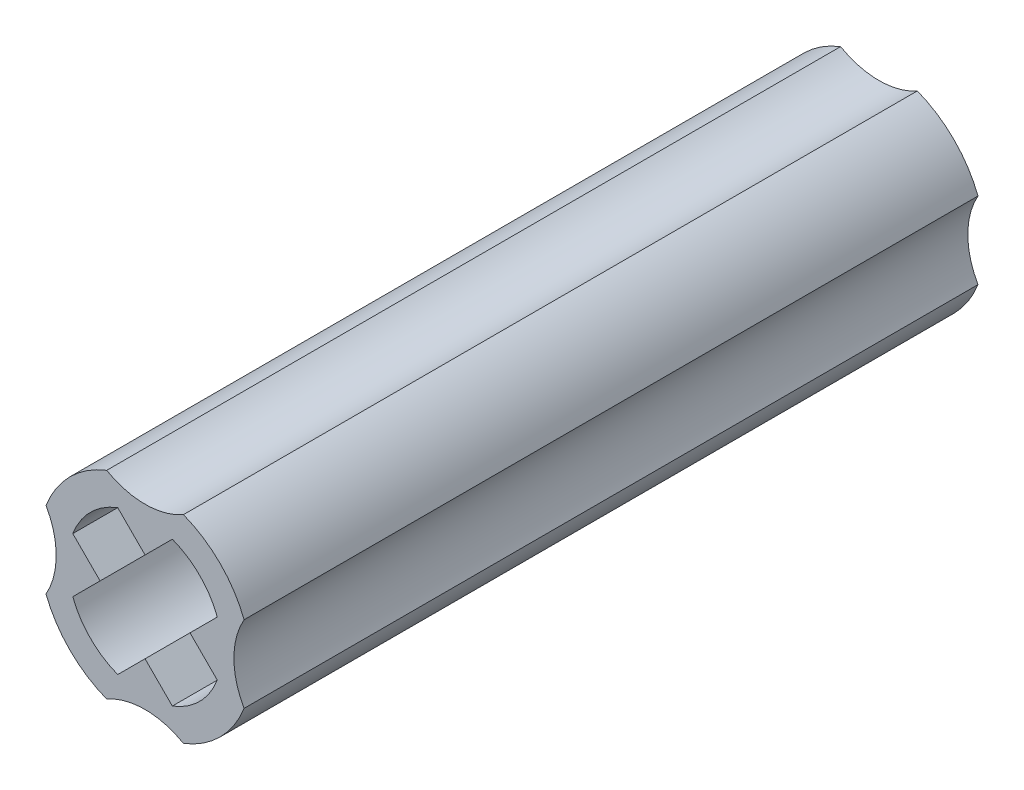
ISO-10303-21;
HEADER;
FILE_DESCRIPTION(('STEP AP214'),'2;1');
FILE_NAME('part.step','',(''),(''),'','','');
FILE_SCHEMA(('AUTOMOTIVE_DESIGN { 1 0 10303 214 1 1 1 1 }'));
ENDSEC;
DATA;
#1=APPLICATION_CONTEXT('core data for automotive mechanical design processes');
#2=APPLICATION_PROTOCOL_DEFINITION('international standard','automotive_design',2000,#1);
#3=PRODUCT_CONTEXT('',#1,'mechanical');
#4=PRODUCT('Part','Part','',(#3));
#5=PRODUCT_RELATED_PRODUCT_CATEGORY('part','',(#4));
#6=PRODUCT_DEFINITION_FORMATION('','',#4);
#7=PRODUCT_DEFINITION_CONTEXT('part definition',#1,'design');
#8=PRODUCT_DEFINITION('design','',#6,#7);
#9=PRODUCT_DEFINITION_SHAPE('','',#8);
#10=(LENGTH_UNIT() NAMED_UNIT(*) SI_UNIT(.MILLI.,.METRE.));
#11=(NAMED_UNIT(*) PLANE_ANGLE_UNIT() SI_UNIT($,.RADIAN.));
#12=(NAMED_UNIT(*) SI_UNIT($,.STERADIAN.) SOLID_ANGLE_UNIT());
#13=UNCERTAINTY_MEASURE_WITH_UNIT(LENGTH_MEASURE(1.E-05),#10,'distance_accuracy_value','');
#14=(GEOMETRIC_REPRESENTATION_CONTEXT(3) GLOBAL_UNCERTAINTY_ASSIGNED_CONTEXT((#13)) GLOBAL_UNIT_ASSIGNED_CONTEXT((#10,
#11,#12)) REPRESENTATION_CONTEXT('',''));
#15=CARTESIAN_POINT('',(0.,0.,0.));
#16=DIRECTION('',(0.,0.,1.));
#17=DIRECTION('',(1.,0.,0.));
#18=AXIS2_PLACEMENT_3D('',#15,#16,#17);
#19=CARTESIAN_POINT('',(0.,0.,-12.065));
#20=DIRECTION('',(0.,0.,1.));
#21=DIRECTION('',(1.,0.,0.));
#22=AXIS2_PLACEMENT_3D('',#19,#20,#21);
#23=CYLINDRICAL_SURFACE('',#22,2.54);
#24=CARTESIAN_POINT('',(0.,0.,-4.1275));
#25=DIRECTION('',(0.,0.,1.));
#26=DIRECTION('',(1.,0.,0.));
#27=AXIS2_PLACEMENT_3D('',#24,#25,#26);
#28=CIRCLE('',#27,2.54);
#29=CARTESIAN_POINT('',(-0.898025612106913,2.37595244060145,-4.1275));
#30=VERTEX_POINT('',#29);
#31=CARTESIAN_POINT('',(-2.37595244060146,0.898025612106913,-4.1275));
#32=VERTEX_POINT('',#31);
#33=EDGE_CURVE('E434',#30,#32,#28,.T.);
#34=ORIENTED_EDGE('',*,*,#33,.T.);
#35=DIRECTION('',(0.,0.,1.));
#36=VECTOR('',#35,1.);
#37=CARTESIAN_POINT('',(-2.37595244060146,0.898025612106913,-12.065));
#38=LINE('',#37,#36);
#39=CARTESIAN_POINT('',(-2.37595244060146,0.898025612106913,-12.065));
#40=VERTEX_POINT('',#39);
#41=EDGE_CURVE('E340',#40,#32,#38,.T.);
#42=ORIENTED_EDGE('',*,*,#41,.F.);
#43=CARTESIAN_POINT('',(0.,0.,-12.065));
#44=DIRECTION('',(0.,0.,1.));
#45=DIRECTION('',(1.,0.,0.));
#46=AXIS2_PLACEMENT_3D('',#43,#44,#45);
#47=CIRCLE('',#46,2.54);
#48=CARTESIAN_POINT('',(-0.898025612106913,2.37595244060145,-12.065));
#49=VERTEX_POINT('',#48);
#50=EDGE_CURVE('E556',#49,#40,#47,.T.);
#51=ORIENTED_EDGE('',*,*,#50,.F.);
#52=DIRECTION('',(0.,0.,1.));
#53=VECTOR('',#52,1.);
#54=CARTESIAN_POINT('',(-0.898025612106913,2.37595244060145,-12.065));
#55=LINE('',#54,#53);
#56=EDGE_CURVE('E376',#49,#30,#55,.T.);
#57=ORIENTED_EDGE('',*,*,#56,.T.);
#58=EDGE_LOOP('',(#34,#42,#51,#57));
#59=FACE_BOUND('',#58,.T.);
#60=ADVANCED_FACE('F38',(#59),#23,.F.);
#61=CARTESIAN_POINT('',(-0.898025612106913,2.37595244060145,-12.065));
#62=DIRECTION('',(0.707106781186549,0.707106781186546,0.));
#63=DIRECTION('',(-0.707106781186546,0.707106781186549,0.));
#64=AXIS2_PLACEMENT_3D('',#61,#62,#63);
#65=PLANE('',#64);
#66=DIRECTION('',(0.707106781186546,-0.707106781186549,0.));
#67=VECTOR('',#66,1.);
#68=CARTESIAN_POINT('',(-0.898025612106913,2.37595244060145,-4.1275));
#69=LINE('',#68,#67);
#70=CARTESIAN_POINT('',(0.,1.47792682849454,-4.1275));
#71=VERTEX_POINT('',#70);
#72=EDGE_CURVE('E54',#30,#71,#69,.T.);
#73=ORIENTED_EDGE('',*,*,#72,.F.);
#74=ORIENTED_EDGE('',*,*,#56,.F.);
#75=DIRECTION('',(-0.707106781186546,0.707106781186549,0.));
#76=VECTOR('',#75,1.);
#77=CARTESIAN_POINT('',(-0.898025612106913,2.37595244060145,-12.065));
#78=LINE('',#77,#76);
#79=CARTESIAN_POINT('',(0.,1.47792682849454,-12.065));
#80=VERTEX_POINT('',#79);
#81=EDGE_CURVE('E597',#80,#49,#78,.T.);
#82=ORIENTED_EDGE('',*,*,#81,.F.);
#83=DIRECTION('',(0.,0.,1.));
#84=VECTOR('',#83,1.);
#85=CARTESIAN_POINT('',(0.,1.47792682849454,-12.065));
#86=LINE('',#85,#84);
#87=EDGE_CURVE('E604',#80,#71,#86,.T.);
#88=ORIENTED_EDGE('',*,*,#87,.T.);
#89=EDGE_LOOP('',(#73,#74,#82,#88));
#90=FACE_BOUND('',#89,.T.);
#91=ADVANCED_FACE('F764',(#90),#65,.F.);
#92=CARTESIAN_POINT('',(0.,1.47792682849454,-12.065));
#93=DIRECTION('',(-0.70710678118655,0.707106781186545,0.));
#94=DIRECTION('',(-0.707106781186545,-0.70710678118655,0.));
#95=AXIS2_PLACEMENT_3D('',#92,#93,#94);
#96=PLANE('',#95);
#97=DIRECTION('',(0.707106781186545,0.70710678118655,0.));
#98=VECTOR('',#97,1.);
#99=CARTESIAN_POINT('',(0.,1.47792682849454,-4.1275));
#100=LINE('',#99,#98);
#101=CARTESIAN_POINT('',(0.898025612106914,2.37595244060146,-4.1275));
#102=VERTEX_POINT('',#101);
#103=EDGE_CURVE('E62',#71,#102,#100,.T.);
#104=ORIENTED_EDGE('',*,*,#103,.F.);
#105=ORIENTED_EDGE('',*,*,#87,.F.);
#106=DIRECTION('',(-0.707106781186545,-0.70710678118655,0.));
#107=VECTOR('',#106,1.);
#108=CARTESIAN_POINT('',(0.,1.47792682849454,-12.065));
#109=LINE('',#108,#107);
#110=CARTESIAN_POINT('',(0.898025612106914,2.37595244060146,-12.065));
#111=VERTEX_POINT('',#110);
#112=EDGE_CURVE('E593',#111,#80,#109,.T.);
#113=ORIENTED_EDGE('',*,*,#112,.F.);
#114=DIRECTION('',(0.,0.,1.));
#115=VECTOR('',#114,1.);
#116=CARTESIAN_POINT('',(0.898025612106914,2.37595244060146,-12.065));
#117=LINE('',#116,#115);
#118=EDGE_CURVE('E607',#111,#102,#117,.T.);
#119=ORIENTED_EDGE('',*,*,#118,.T.);
#120=EDGE_LOOP('',(#104,#105,#113,#119));
#121=FACE_BOUND('',#120,.T.);
#122=ADVANCED_FACE('F770',(#121),#96,.F.);
#123=CARTESIAN_POINT('',(0.,0.,-12.065));
#124=DIRECTION('',(0.,0.,1.));
#125=DIRECTION('',(1.,0.,0.));
#126=AXIS2_PLACEMENT_3D('',#123,#124,#125);
#127=CYLINDRICAL_SURFACE('',#126,2.54);
#128=CARTESIAN_POINT('',(2.37595244060145,0.898025612106914,-4.1275));
#129=VERTEX_POINT('',#128);
#130=EDGE_CURVE('E475',#129,#102,#28,.T.);
#131=ORIENTED_EDGE('',*,*,#130,.T.);
#132=ORIENTED_EDGE('',*,*,#118,.F.);
#133=CARTESIAN_POINT('',(0.,0.,-12.065));
#134=DIRECTION('',(0.,0.,1.));
#135=DIRECTION('',(1.,0.,0.));
#136=AXIS2_PLACEMENT_3D('',#133,#134,#135);
#137=CIRCLE('',#136,2.54);
#138=CARTESIAN_POINT('',(2.37595244060145,0.898025612106914,-12.065));
#139=VERTEX_POINT('',#138);
#140=EDGE_CURVE('E589',#139,#111,#137,.T.);
#141=ORIENTED_EDGE('',*,*,#140,.F.);
#142=DIRECTION('',(0.,0.,1.));
#143=VECTOR('',#142,1.);
#144=CARTESIAN_POINT('',(2.37595244060145,0.898025612106914,-12.065));
#145=LINE('',#144,#143);
#146=EDGE_CURVE('E312',#139,#129,#145,.T.);
#147=ORIENTED_EDGE('',*,*,#146,.T.);
#148=EDGE_LOOP('',(#131,#132,#141,#147));
#149=FACE_BOUND('',#148,.T.);
#150=ADVANCED_FACE('F873',(#149),#127,.F.);
#151=CARTESIAN_POINT('',(2.37595244060145,0.898025612106913,-12.065));
#152=DIRECTION('',(0.707106781186546,-0.707106781186549,0.));
#153=DIRECTION('',(0.707106781186549,0.707106781186546,0.));
#154=AXIS2_PLACEMENT_3D('',#151,#152,#153);
#155=PLANE('',#154);
#156=DIRECTION('',(-0.707106781186549,-0.707106781186546,0.));
#157=VECTOR('',#156,1.);
#158=CARTESIAN_POINT('',(2.37595244060145,0.898025612106913,-4.1275));
#159=LINE('',#158,#157);
#160=CARTESIAN_POINT('',(1.47792682849454,0.,-4.1275));
#161=VERTEX_POINT('',#160);
#162=EDGE_CURVE('E488',#129,#161,#159,.T.);
#163=ORIENTED_EDGE('',*,*,#162,.F.);
#164=ORIENTED_EDGE('',*,*,#146,.F.);
#165=DIRECTION('',(0.707106781186548,0.707106781186546,0.));
#166=VECTOR('',#165,1.);
#167=CARTESIAN_POINT('',(2.37595244060145,0.898025612106913,-12.065));
#168=LINE('',#167,#166);
#169=CARTESIAN_POINT('',(1.47792682849454,0.,-12.065));
#170=VERTEX_POINT('',#169);
#171=EDGE_CURVE('E585',#170,#139,#168,.T.);
#172=ORIENTED_EDGE('',*,*,#171,.F.);
#173=DIRECTION('',(0.,0.,1.));
#174=VECTOR('',#173,1.);
#175=CARTESIAN_POINT('',(1.47792682849454,0.,-12.065));
#176=LINE('',#175,#174);
#177=EDGE_CURVE('E301',#170,#161,#176,.T.);
#178=ORIENTED_EDGE('',*,*,#177,.T.);
#179=EDGE_LOOP('',(#163,#164,#172,#178));
#180=FACE_BOUND('',#179,.T.);
#181=ADVANCED_FACE('F870',(#180),#155,.F.);
#182=CARTESIAN_POINT('',(1.47792682849454,0.,-12.065));
#183=DIRECTION('',(0.707106781186545,0.70710678118655,0.));
#184=DIRECTION('',(-0.70710678118655,0.707106781186545,0.));
#185=AXIS2_PLACEMENT_3D('',#182,#183,#184);
#186=PLANE('',#185);
#187=DIRECTION('',(0.70710678118655,-0.707106781186545,0.));
#188=VECTOR('',#187,1.);
#189=CARTESIAN_POINT('',(1.47792682849454,0.,-4.1275));
#190=LINE('',#189,#188);
#191=CARTESIAN_POINT('',(2.37595244060146,-0.898025612106914,-4.1275));
#192=VERTEX_POINT('',#191);
#193=EDGE_CURVE('E484',#161,#192,#190,.T.);
#194=ORIENTED_EDGE('',*,*,#193,.F.);
#195=ORIENTED_EDGE('',*,*,#177,.F.);
#196=DIRECTION('',(-0.70710678118655,0.707106781186545,0.));
#197=VECTOR('',#196,1.);
#198=CARTESIAN_POINT('',(1.47792682849454,0.,-12.065));
#199=LINE('',#198,#197);
#200=CARTESIAN_POINT('',(2.37595244060146,-0.898025612106914,-12.065));
#201=VERTEX_POINT('',#200);
#202=EDGE_CURVE('E581',#201,#170,#199,.T.);
#203=ORIENTED_EDGE('',*,*,#202,.F.);
#204=DIRECTION('',(0.,0.,1.));
#205=VECTOR('',#204,1.);
#206=CARTESIAN_POINT('',(2.37595244060146,-0.898025612106914,-12.065));
#207=LINE('',#206,#205);
#208=EDGE_CURVE('E302',#201,#192,#207,.T.);
#209=ORIENTED_EDGE('',*,*,#208,.T.);
#210=EDGE_LOOP('',(#194,#195,#203,#209));
#211=FACE_BOUND('',#210,.T.);
#212=ADVANCED_FACE('F867',(#211),#186,.F.);
#213=CARTESIAN_POINT('',(0.,0.,-12.065));
#214=DIRECTION('',(0.,0.,1.));
#215=DIRECTION('',(1.,0.,0.));
#216=AXIS2_PLACEMENT_3D('',#213,#214,#215);
#217=CYLINDRICAL_SURFACE('',#216,2.54);
#218=CARTESIAN_POINT('',(0.898025612106912,-2.37595244060145,-4.1275));
#219=VERTEX_POINT('',#218);
#220=EDGE_CURVE('E285',#219,#192,#28,.T.);
#221=ORIENTED_EDGE('',*,*,#220,.T.);
#222=ORIENTED_EDGE('',*,*,#208,.F.);
#223=CARTESIAN_POINT('',(0.,0.,-12.065));
#224=DIRECTION('',(0.,0.,1.));
#225=DIRECTION('',(1.,0.,0.));
#226=AXIS2_PLACEMENT_3D('',#223,#224,#225);
#227=CIRCLE('',#226,2.54);
#228=CARTESIAN_POINT('',(0.898025612106912,-2.37595244060145,-12.065));
#229=VERTEX_POINT('',#228);
#230=EDGE_CURVE('E577',#229,#201,#227,.T.);
#231=ORIENTED_EDGE('',*,*,#230,.F.);
#232=DIRECTION('',(0.,0.,1.));
#233=VECTOR('',#232,1.);
#234=CARTESIAN_POINT('',(0.898025612106912,-2.37595244060145,-12.065));
#235=LINE('',#234,#233);
#236=EDGE_CURVE('E315',#229,#219,#235,.T.);
#237=ORIENTED_EDGE('',*,*,#236,.T.);
#238=EDGE_LOOP('',(#221,#222,#231,#237));
#239=FACE_BOUND('',#238,.T.);
#240=ADVANCED_FACE('F864',(#239),#217,.F.);
#241=CARTESIAN_POINT('',(0.898025612106914,-2.37595244060145,-12.065));
#242=DIRECTION('',(-0.707106781186549,-0.707106781186547,0.));
#243=DIRECTION('',(0.707106781186547,-0.707106781186549,0.));
#244=AXIS2_PLACEMENT_3D('',#241,#242,#243);
#245=PLANE('',#244);
#246=DIRECTION('',(-0.707106781186547,0.707106781186549,0.));
#247=VECTOR('',#246,1.);
#248=CARTESIAN_POINT('',(0.898025612106914,-2.37595244060145,-4.1275));
#249=LINE('',#248,#247);
#250=CARTESIAN_POINT('',(0.,-1.47792682849454,-4.1275));
#251=VERTEX_POINT('',#250);
#252=EDGE_CURVE('E480',#219,#251,#249,.T.);
#253=ORIENTED_EDGE('',*,*,#252,.F.);
#254=ORIENTED_EDGE('',*,*,#236,.F.);
#255=DIRECTION('',(0.707106781186546,-0.707106781186548,0.));
#256=VECTOR('',#255,1.);
#257=CARTESIAN_POINT('',(0.898025612106914,-2.37595244060145,-12.065));
#258=LINE('',#257,#256);
#259=CARTESIAN_POINT('',(0.,-1.47792682849454,-12.065));
#260=VERTEX_POINT('',#259);
#261=EDGE_CURVE('E573',#260,#229,#258,.T.);
#262=ORIENTED_EDGE('',*,*,#261,.F.);
#263=DIRECTION('',(0.,0.,1.));
#264=VECTOR('',#263,1.);
#265=CARTESIAN_POINT('',(0.,-1.47792682849454,-12.065));
#266=LINE('',#265,#264);
#267=EDGE_CURVE('E320',#260,#251,#266,.T.);
#268=ORIENTED_EDGE('',*,*,#267,.T.);
#269=EDGE_LOOP('',(#253,#254,#262,#268));
#270=FACE_BOUND('',#269,.T.);
#271=ADVANCED_FACE('F861',(#270),#245,.F.);
#272=CARTESIAN_POINT('',(0.,-1.47792682849454,-12.065));
#273=DIRECTION('',(0.70710678118655,-0.707106781186545,0.));
#274=DIRECTION('',(0.707106781186545,0.70710678118655,0.));
#275=AXIS2_PLACEMENT_3D('',#272,#273,#274);
#276=PLANE('',#275);
#277=DIRECTION('',(-0.707106781186545,-0.70710678118655,0.));
#278=VECTOR('',#277,1.);
#279=CARTESIAN_POINT('',(0.,-1.47792682849454,-4.1275));
#280=LINE('',#279,#278);
#281=CARTESIAN_POINT('',(-0.898025612106913,-2.37595244060146,-4.1275));
#282=VERTEX_POINT('',#281);
#283=EDGE_CURVE('E457',#251,#282,#280,.T.);
#284=ORIENTED_EDGE('',*,*,#283,.F.);
#285=ORIENTED_EDGE('',*,*,#267,.F.);
#286=DIRECTION('',(0.707106781186545,0.70710678118655,0.));
#287=VECTOR('',#286,1.);
#288=CARTESIAN_POINT('',(0.,-1.47792682849454,-12.065));
#289=LINE('',#288,#287);
#290=CARTESIAN_POINT('',(-0.898025612106913,-2.37595244060146,-12.065));
#291=VERTEX_POINT('',#290);
#292=EDGE_CURVE('E569',#291,#260,#289,.T.);
#293=ORIENTED_EDGE('',*,*,#292,.F.);
#294=DIRECTION('',(0.,0.,1.));
#295=VECTOR('',#294,1.);
#296=CARTESIAN_POINT('',(-0.898025612106913,-2.37595244060146,-12.065));
#297=LINE('',#296,#295);
#298=EDGE_CURVE('E325',#291,#282,#297,.T.);
#299=ORIENTED_EDGE('',*,*,#298,.T.);
#300=EDGE_LOOP('',(#284,#285,#293,#299));
#301=FACE_BOUND('',#300,.T.);
#302=ADVANCED_FACE('F858',(#301),#276,.F.);
#303=CARTESIAN_POINT('',(0.,0.,-12.065));
#304=DIRECTION('',(0.,0.,1.));
#305=DIRECTION('',(1.,0.,0.));
#306=AXIS2_PLACEMENT_3D('',#303,#304,#305);
#307=CYLINDRICAL_SURFACE('',#306,2.54);
#308=CARTESIAN_POINT('',(-2.37595244060145,-0.898025612106914,-4.1275));
#309=VERTEX_POINT('',#308);
#310=EDGE_CURVE('E455',#309,#282,#28,.T.);
#311=ORIENTED_EDGE('',*,*,#310,.T.);
#312=ORIENTED_EDGE('',*,*,#298,.F.);
#313=CARTESIAN_POINT('',(0.,0.,-12.065));
#314=DIRECTION('',(0.,0.,1.));
#315=DIRECTION('',(1.,0.,0.));
#316=AXIS2_PLACEMENT_3D('',#313,#314,#315);
#317=CIRCLE('',#316,2.54);
#318=CARTESIAN_POINT('',(-2.37595244060145,-0.898025612106914,-12.065));
#319=VERTEX_POINT('',#318);
#320=EDGE_CURVE('E565',#319,#291,#317,.T.);
#321=ORIENTED_EDGE('',*,*,#320,.F.);
#322=DIRECTION('',(0.,0.,1.));
#323=VECTOR('',#322,1.);
#324=CARTESIAN_POINT('',(-2.37595244060145,-0.898025612106914,-12.065));
#325=LINE('',#324,#323);
#326=EDGE_CURVE('E330',#319,#309,#325,.T.);
#327=ORIENTED_EDGE('',*,*,#326,.T.);
#328=EDGE_LOOP('',(#311,#312,#321,#327));
#329=FACE_BOUND('',#328,.T.);
#330=ADVANCED_FACE('F845',(#329),#307,.F.);
#331=CARTESIAN_POINT('',(-2.37595244060145,-0.898025612106914,-12.065));
#332=DIRECTION('',(-0.707106781186547,0.707106781186549,0.));
#333=DIRECTION('',(-0.707106781186549,-0.707106781186547,0.));
#334=AXIS2_PLACEMENT_3D('',#331,#332,#333);
#335=PLANE('',#334);
#336=DIRECTION('',(0.707106781186549,0.707106781186547,0.));
#337=VECTOR('',#336,1.);
#338=CARTESIAN_POINT('',(-2.37595244060145,-0.898025612106914,-4.1275));
#339=LINE('',#338,#337);
#340=CARTESIAN_POINT('',(-1.47792682849454,0.,-4.1275));
#341=VERTEX_POINT('',#340);
#342=EDGE_CURVE('E445',#309,#341,#339,.T.);
#343=ORIENTED_EDGE('',*,*,#342,.F.);
#344=ORIENTED_EDGE('',*,*,#326,.F.);
#345=DIRECTION('',(-0.707106781186548,-0.707106781186546,0.));
#346=VECTOR('',#345,1.);
#347=CARTESIAN_POINT('',(-2.37595244060145,-0.898025612106914,-12.065));
#348=LINE('',#347,#346);
#349=CARTESIAN_POINT('',(-1.47792682849454,0.,-12.065));
#350=VERTEX_POINT('',#349);
#351=EDGE_CURVE('E447',#350,#319,#348,.T.);
#352=ORIENTED_EDGE('',*,*,#351,.F.);
#353=DIRECTION('',(0.,0.,1.));
#354=VECTOR('',#353,1.);
#355=CARTESIAN_POINT('',(-1.47792682849454,0.,-12.065));
#356=LINE('',#355,#354);
#357=EDGE_CURVE('E335',#350,#341,#356,.T.);
#358=ORIENTED_EDGE('',*,*,#357,.T.);
#359=EDGE_LOOP('',(#343,#344,#352,#358));
#360=FACE_BOUND('',#359,.T.);
#361=ADVANCED_FACE('F444',(#360),#335,.F.);
#362=CARTESIAN_POINT('',(-1.47792682849454,0.,-12.065));
#363=DIRECTION('',(-0.707106781186545,-0.70710678118655,0.));
#364=DIRECTION('',(0.70710678118655,-0.707106781186545,0.));
#365=AXIS2_PLACEMENT_3D('',#362,#363,#364);
#366=PLANE('',#365);
#367=DIRECTION('',(-0.70710678118655,0.707106781186545,0.));
#368=VECTOR('',#367,1.);
#369=CARTESIAN_POINT('',(-1.47792682849454,0.,-4.1275));
#370=LINE('',#369,#368);
#371=EDGE_CURVE('E47',#341,#32,#370,.T.);
#372=ORIENTED_EDGE('',*,*,#371,.F.);
#373=ORIENTED_EDGE('',*,*,#357,.F.);
#374=DIRECTION('',(0.70710678118655,-0.707106781186545,0.));
#375=VECTOR('',#374,1.);
#376=CARTESIAN_POINT('',(-1.47792682849454,0.,-12.065));
#377=LINE('',#376,#375);
#378=EDGE_CURVE('E560',#40,#350,#377,.T.);
#379=ORIENTED_EDGE('',*,*,#378,.F.);
#380=ORIENTED_EDGE('',*,*,#41,.T.);
#381=EDGE_LOOP('',(#372,#373,#379,#380));
#382=FACE_BOUND('',#381,.T.);
#383=ADVANCED_FACE('F439',(#382),#366,.F.);
#384=CARTESIAN_POINT('',(0.,0.,12.065));
#385=DIRECTION('',(0.,0.,-1.));
#386=DIRECTION('',(-1.,0.,0.));
#387=AXIS2_PLACEMENT_3D('',#384,#385,#386);
#388=CYLINDRICAL_SURFACE('',#387,3.4925);
#389=CARTESIAN_POINT('',(0.,0.,-12.065));
#390=DIRECTION('',(0.,0.,1.));
#391=DIRECTION('',(1.,0.,0.));
#392=AXIS2_PLACEMENT_3D('',#389,#390,#391);
#393=CIRCLE('',#392,3.4925);
#394=CARTESIAN_POINT('',(-1.26181498824251,3.25659011627907,-12.065));
#395=VERTEX_POINT('',#394);
#396=CARTESIAN_POINT('',(-3.25659011627907,1.26181498824253,-12.065));
#397=VERTEX_POINT('',#396);
#398=EDGE_CURVE('E371',#395,#397,#393,.T.);
#399=ORIENTED_EDGE('',*,*,#398,.T.);
#400=DIRECTION('',(0.,0.,-1.));
#401=VECTOR('',#400,1.);
#402=CARTESIAN_POINT('',(-3.25659011627907,1.26181498824253,12.065));
#403=LINE('',#402,#401);
#404=CARTESIAN_POINT('',(-3.25659011627907,1.26181498824253,12.065));
#405=VERTEX_POINT('',#404);
#406=EDGE_CURVE('E423',#405,#397,#403,.T.);
#407=ORIENTED_EDGE('',*,*,#406,.F.);
#408=CARTESIAN_POINT('',(0.,0.,12.065));
#409=DIRECTION('',(0.,0.,1.));
#410=DIRECTION('',(1.,0.,0.));
#411=AXIS2_PLACEMENT_3D('',#408,#409,#410);
#412=CIRCLE('',#411,3.4925);
#413=CARTESIAN_POINT('',(-1.26181498824251,3.25659011627907,12.065));
#414=VERTEX_POINT('',#413);
#415=EDGE_CURVE('E344',#414,#405,#412,.T.);
#416=ORIENTED_EDGE('',*,*,#415,.F.);
#417=DIRECTION('',(0.,0.,-1.));
#418=VECTOR('',#417,1.);
#419=CARTESIAN_POINT('',(-1.26181498824251,3.25659011627907,12.065));
#420=LINE('',#419,#418);
#421=EDGE_CURVE('E370',#414,#395,#420,.T.);
#422=ORIENTED_EDGE('',*,*,#421,.T.);
#423=EDGE_LOOP('',(#399,#407,#416,#422));
#424=FACE_BOUND('',#423,.T.);
#425=ADVANCED_FACE('F40',(#424),#388,.T.);
#426=CARTESIAN_POINT('',(-5.461,0.,12.065));
#427=DIRECTION('',(0.,0.,-1.));
#428=DIRECTION('',(-1.,0.,0.));
#429=AXIS2_PLACEMENT_3D('',#426,#427,#428);
#430=CYLINDRICAL_SURFACE('',#429,2.54);
#431=CARTESIAN_POINT('',(-5.461,0.,-12.065));
#432=DIRECTION('',(0.,0.,-1.));
#433=DIRECTION('',(1.,0.,0.));
#434=AXIS2_PLACEMENT_3D('',#431,#432,#433);
#435=CIRCLE('',#434,2.54);
#436=CARTESIAN_POINT('',(-3.25659011627907,-1.26181498824253,-12.065));
#437=VERTEX_POINT('',#436);
#438=EDGE_CURVE('E375',#397,#437,#435,.T.);
#439=ORIENTED_EDGE('',*,*,#438,.T.);
#440=DIRECTION('',(0.,0.,-1.));
#441=VECTOR('',#440,1.);
#442=CARTESIAN_POINT('',(-3.25659011627907,-1.26181498824253,12.065));
#443=LINE('',#442,#441);
#444=CARTESIAN_POINT('',(-3.25659011627907,-1.26181498824253,12.065));
#445=VERTEX_POINT('',#444);
#446=EDGE_CURVE('E419',#445,#437,#443,.T.);
#447=ORIENTED_EDGE('',*,*,#446,.F.);
#448=CARTESIAN_POINT('',(-5.461,0.,12.065));
#449=DIRECTION('',(0.,0.,-1.));
#450=DIRECTION('',(1.,0.,0.));
#451=AXIS2_PLACEMENT_3D('',#448,#449,#450);
#452=CIRCLE('',#451,2.54);
#453=EDGE_CURVE('E348',#405,#445,#452,.T.);
#454=ORIENTED_EDGE('',*,*,#453,.F.);
#455=ORIENTED_EDGE('',*,*,#406,.T.);
#456=EDGE_LOOP('',(#439,#447,#454,#455));
#457=FACE_BOUND('',#456,.T.);
#458=ADVANCED_FACE('F809',(#457),#430,.F.);
#459=CARTESIAN_POINT('',(0.,0.,12.065));
#460=DIRECTION('',(0.,0.,-1.));
#461=DIRECTION('',(-1.,0.,0.));
#462=AXIS2_PLACEMENT_3D('',#459,#460,#461);
#463=CYLINDRICAL_SURFACE('',#462,3.4925);
#464=CARTESIAN_POINT('',(0.,0.,-12.065));
#465=DIRECTION('',(0.,0.,1.));
#466=DIRECTION('',(1.,0.,0.));
#467=AXIS2_PLACEMENT_3D('',#464,#465,#466);
#468=CIRCLE('',#467,3.4925);
#469=CARTESIAN_POINT('',(-1.26181498824256,-3.25659011627906,-12.065));
#470=VERTEX_POINT('',#469);
#471=EDGE_CURVE('E379',#437,#470,#468,.T.);
#472=ORIENTED_EDGE('',*,*,#471,.T.);
#473=DIRECTION('',(0.,0.,-1.));
#474=VECTOR('',#473,1.);
#475=CARTESIAN_POINT('',(-1.26181498824256,-3.25659011627906,12.065));
#476=LINE('',#475,#474);
#477=CARTESIAN_POINT('',(-1.26181498824256,-3.25659011627906,12.065));
#478=VERTEX_POINT('',#477);
#479=EDGE_CURVE('E415',#478,#470,#476,.T.);
#480=ORIENTED_EDGE('',*,*,#479,.F.);
#481=CARTESIAN_POINT('',(0.,0.,12.065));
#482=DIRECTION('',(0.,0.,1.));
#483=DIRECTION('',(1.,0.,0.));
#484=AXIS2_PLACEMENT_3D('',#481,#482,#483);
#485=CIRCLE('',#484,3.4925);
#486=EDGE_CURVE('E352',#445,#478,#485,.T.);
#487=ORIENTED_EDGE('',*,*,#486,.F.);
#488=ORIENTED_EDGE('',*,*,#446,.T.);
#489=EDGE_LOOP('',(#472,#480,#487,#488));
#490=FACE_BOUND('',#489,.T.);
#491=ADVANCED_FACE('F806',(#490),#463,.T.);
#492=CARTESIAN_POINT('',(0.,-5.461,12.065));
#493=DIRECTION('',(0.,0.,-1.));
#494=DIRECTION('',(-1.,0.,0.));
#495=AXIS2_PLACEMENT_3D('',#492,#493,#494);
#496=CYLINDRICAL_SURFACE('',#495,2.54);
#497=CARTESIAN_POINT('',(0.,-5.461,-12.065));
#498=DIRECTION('',(0.,0.,-1.));
#499=DIRECTION('',(1.,0.,0.));
#500=AXIS2_PLACEMENT_3D('',#497,#498,#499);
#501=CIRCLE('',#500,2.54);
#502=CARTESIAN_POINT('',(1.26181498824249,-3.25659011627908,-12.065));
#503=VERTEX_POINT('',#502);
#504=EDGE_CURVE('E382',#470,#503,#501,.T.);
#505=ORIENTED_EDGE('',*,*,#504,.T.);
#506=DIRECTION('',(0.,0.,-1.));
#507=VECTOR('',#506,1.);
#508=CARTESIAN_POINT('',(1.26181498824249,-3.25659011627908,12.065));
#509=LINE('',#508,#507);
#510=CARTESIAN_POINT('',(1.26181498824249,-3.25659011627908,12.065));
#511=VERTEX_POINT('',#510);
#512=EDGE_CURVE('E411',#511,#503,#509,.T.);
#513=ORIENTED_EDGE('',*,*,#512,.F.);
#514=CARTESIAN_POINT('',(0.,-5.461,12.065));
#515=DIRECTION('',(0.,0.,-1.));
#516=DIRECTION('',(1.,0.,0.));
#517=AXIS2_PLACEMENT_3D('',#514,#515,#516);
#518=CIRCLE('',#517,2.54);
#519=EDGE_CURVE('E355',#478,#511,#518,.T.);
#520=ORIENTED_EDGE('',*,*,#519,.F.);
#521=ORIENTED_EDGE('',*,*,#479,.T.);
#522=EDGE_LOOP('',(#505,#513,#520,#521));
#523=FACE_BOUND('',#522,.T.);
#524=ADVANCED_FACE('F802',(#523),#496,.F.);
#525=CARTESIAN_POINT('',(0.,0.,12.065));
#526=DIRECTION('',(0.,0.,-1.));
#527=DIRECTION('',(-1.,0.,0.));
#528=AXIS2_PLACEMENT_3D('',#525,#526,#527);
#529=CYLINDRICAL_SURFACE('',#528,3.4925);
#530=CARTESIAN_POINT('',(0.,0.,-12.065));
#531=DIRECTION('',(0.,0.,1.));
#532=DIRECTION('',(1.,0.,0.));
#533=AXIS2_PLACEMENT_3D('',#530,#531,#532);
#534=CIRCLE('',#533,3.4925);
#535=CARTESIAN_POINT('',(3.25659011627906,-1.26181498824255,-12.065));
#536=VERTEX_POINT('',#535);
#537=EDGE_CURVE('E385',#503,#536,#534,.T.);
#538=ORIENTED_EDGE('',*,*,#537,.T.);
#539=DIRECTION('',(0.,0.,-1.));
#540=VECTOR('',#539,1.);
#541=CARTESIAN_POINT('',(3.25659011627906,-1.26181498824255,12.065));
#542=LINE('',#541,#540);
#543=CARTESIAN_POINT('',(3.25659011627906,-1.26181498824255,12.065));
#544=VERTEX_POINT('',#543);
#545=EDGE_CURVE('E407',#544,#536,#542,.T.);
#546=ORIENTED_EDGE('',*,*,#545,.F.);
#547=CARTESIAN_POINT('',(0.,0.,12.065));
#548=DIRECTION('',(0.,0.,1.));
#549=DIRECTION('',(1.,0.,0.));
#550=AXIS2_PLACEMENT_3D('',#547,#548,#549);
#551=CIRCLE('',#550,3.4925);
#552=EDGE_CURVE('E358',#511,#544,#551,.T.);
#553=ORIENTED_EDGE('',*,*,#552,.F.);
#554=ORIENTED_EDGE('',*,*,#512,.T.);
#555=EDGE_LOOP('',(#538,#546,#553,#554));
#556=FACE_BOUND('',#555,.T.);
#557=ADVANCED_FACE('F798',(#556),#529,.T.);
#558=CARTESIAN_POINT('',(5.461,0.,12.065));
#559=DIRECTION('',(0.,0.,-1.));
#560=DIRECTION('',(-1.,0.,0.));
#561=AXIS2_PLACEMENT_3D('',#558,#559,#560);
#562=CYLINDRICAL_SURFACE('',#561,2.54);
#563=CARTESIAN_POINT('',(5.461,0.,-12.065));
#564=DIRECTION('',(0.,0.,-1.));
#565=DIRECTION('',(1.,0.,0.));
#566=AXIS2_PLACEMENT_3D('',#563,#564,#565);
#567=CIRCLE('',#566,2.54);
#568=CARTESIAN_POINT('',(3.25659011627908,1.2618149882425,-12.065));
#569=VERTEX_POINT('',#568);
#570=EDGE_CURVE('E388',#536,#569,#567,.T.);
#571=ORIENTED_EDGE('',*,*,#570,.T.);
#572=DIRECTION('',(0.,0.,-1.));
#573=VECTOR('',#572,1.);
#574=CARTESIAN_POINT('',(3.25659011627908,1.2618149882425,12.065));
#575=LINE('',#574,#573);
#576=CARTESIAN_POINT('',(3.25659011627908,1.2618149882425,12.065));
#577=VERTEX_POINT('',#576);
#578=EDGE_CURVE('E403',#577,#569,#575,.T.);
#579=ORIENTED_EDGE('',*,*,#578,.F.);
#580=CARTESIAN_POINT('',(5.461,0.,12.065));
#581=DIRECTION('',(0.,0.,-1.));
#582=DIRECTION('',(1.,0.,0.));
#583=AXIS2_PLACEMENT_3D('',#580,#581,#582);
#584=CIRCLE('',#583,2.54);
#585=EDGE_CURVE('E361',#544,#577,#584,.T.);
#586=ORIENTED_EDGE('',*,*,#585,.F.);
#587=ORIENTED_EDGE('',*,*,#545,.T.);
#588=EDGE_LOOP('',(#571,#579,#586,#587));
#589=FACE_BOUND('',#588,.T.);
#590=ADVANCED_FACE('F794',(#589),#562,.F.);
#591=CARTESIAN_POINT('',(0.,0.,12.065));
#592=DIRECTION('',(0.,0.,-1.));
#593=DIRECTION('',(-1.,0.,0.));
#594=AXIS2_PLACEMENT_3D('',#591,#592,#593);
#595=CYLINDRICAL_SURFACE('',#594,3.4925);
#596=CARTESIAN_POINT('',(0.,0.,-12.065));
#597=DIRECTION('',(0.,0.,1.));
#598=DIRECTION('',(1.,0.,0.));
#599=AXIS2_PLACEMENT_3D('',#596,#597,#598);
#600=CIRCLE('',#599,3.4925);
#601=CARTESIAN_POINT('',(1.26181498824254,3.25659011627907,-12.065));
#602=VERTEX_POINT('',#601);
#603=EDGE_CURVE('E391',#569,#602,#600,.T.);
#604=ORIENTED_EDGE('',*,*,#603,.T.);
#605=DIRECTION('',(0.,0.,-1.));
#606=VECTOR('',#605,1.);
#607=CARTESIAN_POINT('',(1.26181498824254,3.25659011627907,12.065));
#608=LINE('',#607,#606);
#609=CARTESIAN_POINT('',(1.26181498824254,3.25659011627907,12.065));
#610=VERTEX_POINT('',#609);
#611=EDGE_CURVE('E399',#610,#602,#608,.T.);
#612=ORIENTED_EDGE('',*,*,#611,.F.);
#613=CARTESIAN_POINT('',(0.,0.,12.065));
#614=DIRECTION('',(0.,0.,1.));
#615=DIRECTION('',(1.,0.,0.));
#616=AXIS2_PLACEMENT_3D('',#613,#614,#615);
#617=CIRCLE('',#616,3.4925);
#618=EDGE_CURVE('E364',#577,#610,#617,.T.);
#619=ORIENTED_EDGE('',*,*,#618,.F.);
#620=ORIENTED_EDGE('',*,*,#578,.T.);
#621=EDGE_LOOP('',(#604,#612,#619,#620));
#622=FACE_BOUND('',#621,.T.);
#623=ADVANCED_FACE('F790',(#622),#595,.T.);
#624=CARTESIAN_POINT('',(0.,5.461,12.065));
#625=DIRECTION('',(0.,0.,-1.));
#626=DIRECTION('',(-1.,0.,0.));
#627=AXIS2_PLACEMENT_3D('',#624,#625,#626);
#628=CYLINDRICAL_SURFACE('',#627,2.54);
#629=CARTESIAN_POINT('',(0.,5.461,-12.065));
#630=DIRECTION('',(0.,0.,-1.));
#631=DIRECTION('',(1.,0.,0.));
#632=AXIS2_PLACEMENT_3D('',#629,#630,#631);
#633=CIRCLE('',#632,2.54);
#634=EDGE_CURVE('E349',#602,#395,#633,.T.);
#635=ORIENTED_EDGE('',*,*,#634,.T.);
#636=ORIENTED_EDGE('',*,*,#421,.F.);
#637=CARTESIAN_POINT('',(0.,5.461,12.065));
#638=DIRECTION('',(0.,0.,-1.));
#639=DIRECTION('',(1.,0.,0.));
#640=AXIS2_PLACEMENT_3D('',#637,#638,#639);
#641=CIRCLE('',#640,2.54);
#642=EDGE_CURVE('E367',#610,#414,#641,.T.);
#643=ORIENTED_EDGE('',*,*,#642,.F.);
#644=ORIENTED_EDGE('',*,*,#611,.T.);
#645=EDGE_LOOP('',(#635,#636,#643,#644));
#646=FACE_BOUND('',#645,.T.);
#647=ADVANCED_FACE('F785',(#646),#628,.F.);
#648=CARTESIAN_POINT('',(-2.7305,0.,12.065));
#649=DIRECTION('',(0.,0.,1.));
#650=DIRECTION('',(1.,0.,0.));
#651=AXIS2_PLACEMENT_3D('',#648,#649,#650);
#652=PLANE('',#651);
#653=CARTESIAN_POINT('',(0.,0.,12.065));
#654=DIRECTION('',(0.,0.,1.));
#655=DIRECTION('',(1.,0.,0.));
#656=AXIS2_PLACEMENT_3D('',#653,#654,#655);
#657=CIRCLE('',#656,2.54);
#658=CARTESIAN_POINT('',(-0.898025612106913,2.37595244060145,12.065));
#659=VERTEX_POINT('',#658);
#660=CARTESIAN_POINT('',(-2.37595244060146,0.898025612106913,12.065));
#661=VERTEX_POINT('',#660);
#662=EDGE_CURVE('E511',#659,#661,#657,.T.);
#663=ORIENTED_EDGE('',*,*,#662,.F.);
#664=DIRECTION('',(-0.707106781186546,0.707106781186549,0.));
#665=VECTOR('',#664,1.);
#666=CARTESIAN_POINT('',(-0.898025612106913,2.37595244060145,12.065));
#667=LINE('',#666,#665);
#668=CARTESIAN_POINT('',(0.,1.47792682849454,12.065));
#669=VERTEX_POINT('',#668);
#670=EDGE_CURVE('E552',#669,#659,#667,.T.);
#671=ORIENTED_EDGE('',*,*,#670,.F.);
#672=DIRECTION('',(-0.707106781186545,-0.70710678118655,0.));
#673=VECTOR('',#672,1.);
#674=CARTESIAN_POINT('',(0.,1.47792682849454,12.065));
#675=LINE('',#674,#673);
#676=CARTESIAN_POINT('',(0.898025612106914,2.37595244060146,12.065));
#677=VERTEX_POINT('',#676);
#678=EDGE_CURVE('E548',#677,#669,#675,.T.);
#679=ORIENTED_EDGE('',*,*,#678,.F.);
#680=CARTESIAN_POINT('',(0.,0.,12.065));
#681=DIRECTION('',(0.,0.,1.));
#682=DIRECTION('',(1.,0.,0.));
#683=AXIS2_PLACEMENT_3D('',#680,#681,#682);
#684=CIRCLE('',#683,2.54);
#685=CARTESIAN_POINT('',(2.37595244060145,0.898025612106914,12.065));
#686=VERTEX_POINT('',#685);
#687=EDGE_CURVE('E544',#686,#677,#684,.T.);
#688=ORIENTED_EDGE('',*,*,#687,.F.);
#689=DIRECTION('',(0.707106781186548,0.707106781186546,0.));
#690=VECTOR('',#689,1.);
#691=CARTESIAN_POINT('',(2.37595244060145,0.898025612106913,12.065));
#692=LINE('',#691,#690);
#693=CARTESIAN_POINT('',(1.47792682849454,0.,12.065));
#694=VERTEX_POINT('',#693);
#695=EDGE_CURVE('E541',#694,#686,#692,.T.);
#696=ORIENTED_EDGE('',*,*,#695,.F.);
#697=DIRECTION('',(-0.70710678118655,0.707106781186545,0.));
#698=VECTOR('',#697,1.);
#699=CARTESIAN_POINT('',(1.47792682849454,0.,12.065));
#700=LINE('',#699,#698);
#701=CARTESIAN_POINT('',(2.37595244060146,-0.898025612106914,12.065));
#702=VERTEX_POINT('',#701);
#703=EDGE_CURVE('E298',#702,#694,#700,.T.);
#704=ORIENTED_EDGE('',*,*,#703,.F.);
#705=CARTESIAN_POINT('',(0.,0.,12.065));
#706=DIRECTION('',(0.,0.,1.));
#707=DIRECTION('',(1.,0.,0.));
#708=AXIS2_PLACEMENT_3D('',#705,#706,#707);
#709=CIRCLE('',#708,2.54);
#710=CARTESIAN_POINT('',(0.898025612106912,-2.37595244060145,12.065));
#711=VERTEX_POINT('',#710);
#712=EDGE_CURVE('E535',#711,#702,#709,.T.);
#713=ORIENTED_EDGE('',*,*,#712,.F.);
#714=DIRECTION('',(0.707106781186546,-0.707106781186548,0.));
#715=VECTOR('',#714,1.);
#716=CARTESIAN_POINT('',(0.898025612106914,-2.37595244060145,12.065));
#717=LINE('',#716,#715);
#718=CARTESIAN_POINT('',(0.,-1.47792682849454,12.065));
#719=VERTEX_POINT('',#718);
#720=EDGE_CURVE('E531',#719,#711,#717,.T.);
#721=ORIENTED_EDGE('',*,*,#720,.F.);
#722=DIRECTION('',(0.707106781186545,0.70710678118655,0.));
#723=VECTOR('',#722,1.);
#724=CARTESIAN_POINT('',(0.,-1.47792682849454,12.065));
#725=LINE('',#724,#723);
#726=CARTESIAN_POINT('',(-0.898025612106913,-2.37595244060146,12.065));
#727=VERTEX_POINT('',#726);
#728=EDGE_CURVE('E527',#727,#719,#725,.T.);
#729=ORIENTED_EDGE('',*,*,#728,.F.);
#730=CARTESIAN_POINT('',(0.,0.,12.065));
#731=DIRECTION('',(0.,0.,1.));
#732=DIRECTION('',(1.,0.,0.));
#733=AXIS2_PLACEMENT_3D('',#730,#731,#732);
#734=CIRCLE('',#733,2.54);
#735=CARTESIAN_POINT('',(-2.37595244060145,-0.898025612106914,12.065));
#736=VERTEX_POINT('',#735);
#737=EDGE_CURVE('E523',#736,#727,#734,.T.);
#738=ORIENTED_EDGE('',*,*,#737,.F.);
#739=DIRECTION('',(-0.707106781186548,-0.707106781186546,0.));
#740=VECTOR('',#739,1.);
#741=CARTESIAN_POINT('',(-2.37595244060145,-0.898025612106914,12.065));
#742=LINE('',#741,#740);
#743=CARTESIAN_POINT('',(-1.47792682849454,0.,12.065));
#744=VERTEX_POINT('',#743);
#745=EDGE_CURVE('E519',#744,#736,#742,.T.);
#746=ORIENTED_EDGE('',*,*,#745,.F.);
#747=DIRECTION('',(0.70710678118655,-0.707106781186545,0.));
#748=VECTOR('',#747,1.);
#749=CARTESIAN_POINT('',(-1.47792682849454,0.,12.065));
#750=LINE('',#749,#748);
#751=EDGE_CURVE('E515',#661,#744,#750,.T.);
#752=ORIENTED_EDGE('',*,*,#751,.F.);
#753=EDGE_LOOP('',(#663,#671,#679,#688,#696,#704,#713,#721,#729,#738,#746,#752));
#754=FACE_BOUND('',#753,.T.);
#755=ORIENTED_EDGE('',*,*,#415,.T.);
#756=ORIENTED_EDGE('',*,*,#453,.T.);
#757=ORIENTED_EDGE('',*,*,#486,.T.);
#758=ORIENTED_EDGE('',*,*,#519,.T.);
#759=ORIENTED_EDGE('',*,*,#552,.T.);
#760=ORIENTED_EDGE('',*,*,#585,.T.);
#761=ORIENTED_EDGE('',*,*,#618,.T.);
#762=ORIENTED_EDGE('',*,*,#642,.T.);
#763=EDGE_LOOP('',(#755,#756,#757,#758,#759,#760,#761,#762));
#764=FACE_BOUND('',#763,.T.);
#765=ADVANCED_FACE('F631',(#754,#764),#652,.T.);
#766=CARTESIAN_POINT('',(-2.7305,0.,-12.065));
#767=DIRECTION('',(0.,0.,1.));
#768=DIRECTION('',(1.,0.,0.));
#769=AXIS2_PLACEMENT_3D('',#766,#767,#768);
#770=PLANE('',#769);
#771=ORIENTED_EDGE('',*,*,#81,.T.);
#772=ORIENTED_EDGE('',*,*,#50,.T.);
#773=ORIENTED_EDGE('',*,*,#378,.T.);
#774=ORIENTED_EDGE('',*,*,#351,.T.);
#775=ORIENTED_EDGE('',*,*,#320,.T.);
#776=ORIENTED_EDGE('',*,*,#292,.T.);
#777=ORIENTED_EDGE('',*,*,#261,.T.);
#778=ORIENTED_EDGE('',*,*,#230,.T.);
#779=ORIENTED_EDGE('',*,*,#202,.T.);
#780=ORIENTED_EDGE('',*,*,#171,.T.);
#781=ORIENTED_EDGE('',*,*,#140,.T.);
#782=ORIENTED_EDGE('',*,*,#112,.T.);
#783=EDGE_LOOP('',(#771,#772,#773,#774,#775,#776,#777,#778,#779,#780,#781,#782));
#784=FACE_BOUND('',#783,.T.);
#785=ORIENTED_EDGE('',*,*,#398,.F.);
#786=ORIENTED_EDGE('',*,*,#634,.F.);
#787=ORIENTED_EDGE('',*,*,#603,.F.);
#788=ORIENTED_EDGE('',*,*,#570,.F.);
#789=ORIENTED_EDGE('',*,*,#537,.F.);
#790=ORIENTED_EDGE('',*,*,#504,.F.);
#791=ORIENTED_EDGE('',*,*,#471,.F.);
#792=ORIENTED_EDGE('',*,*,#438,.F.);
#793=EDGE_LOOP('',(#785,#786,#787,#788,#789,#790,#791,#792));
#794=FACE_BOUND('',#793,.T.);
#795=ADVANCED_FACE('F775',(#784,#794),#770,.F.);
#796=CARTESIAN_POINT('',(-2.37595244060146,0.898025612106913,4.12749999999999));
#797=VERTEX_POINT('',#796);
#798=EDGE_CURVE('E343',#797,#661,#38,.T.);
#799=ORIENTED_EDGE('',*,*,#798,.F.);
#800=CARTESIAN_POINT('',(0.,0.,4.1275));
#801=DIRECTION('',(0.,0.,1.));
#802=DIRECTION('',(1.,0.,0.));
#803=AXIS2_PLACEMENT_3D('',#800,#801,#802);
#804=CIRCLE('',#803,2.54);
#805=CARTESIAN_POINT('',(-0.898025612106915,2.37595244060146,4.1275));
#806=VERTEX_POINT('',#805);
#807=EDGE_CURVE('E474',#806,#797,#804,.T.);
#808=ORIENTED_EDGE('',*,*,#807,.F.);
#809=EDGE_CURVE('E603',#806,#659,#55,.T.);
#810=ORIENTED_EDGE('',*,*,#809,.T.);
#811=ORIENTED_EDGE('',*,*,#662,.T.);
#812=EDGE_LOOP('',(#799,#808,#810,#811));
#813=FACE_BOUND('',#812,.T.);
#814=ADVANCED_FACE('F644',(#813),#23,.F.);
#815=ORIENTED_EDGE('',*,*,#809,.F.);
#816=DIRECTION('',(0.707106781186546,-0.707106781186549,0.));
#817=VECTOR('',#816,1.);
#818=CARTESIAN_POINT('',(-0.898025612106913,2.37595244060145,4.1275));
#819=LINE('',#818,#817);
#820=CARTESIAN_POINT('',(0.,1.47792682849454,4.1275));
#821=VERTEX_POINT('',#820);
#822=EDGE_CURVE('E508',#806,#821,#819,.T.);
#823=ORIENTED_EDGE('',*,*,#822,.T.);
#824=EDGE_CURVE('E606',#821,#669,#86,.T.);
#825=ORIENTED_EDGE('',*,*,#824,.T.);
#826=ORIENTED_EDGE('',*,*,#670,.T.);
#827=EDGE_LOOP('',(#815,#823,#825,#826));
#828=FACE_BOUND('',#827,.T.);
#829=ADVANCED_FACE('F638',(#828),#65,.F.);
#830=ORIENTED_EDGE('',*,*,#824,.F.);
#831=DIRECTION('',(0.707106781186545,0.70710678118655,0.));
#832=VECTOR('',#831,1.);
#833=CARTESIAN_POINT('',(0.,1.47792682849454,4.1275));
#834=LINE('',#833,#832);
#835=CARTESIAN_POINT('',(0.898025612106914,2.37595244060146,4.1275));
#836=VERTEX_POINT('',#835);
#837=EDGE_CURVE('E282',#821,#836,#834,.T.);
#838=ORIENTED_EDGE('',*,*,#837,.T.);
#839=EDGE_CURVE('E609',#836,#677,#117,.T.);
#840=ORIENTED_EDGE('',*,*,#839,.T.);
#841=ORIENTED_EDGE('',*,*,#678,.T.);
#842=EDGE_LOOP('',(#830,#838,#840,#841));
#843=FACE_BOUND('',#842,.T.);
#844=ADVANCED_FACE('F635',(#843),#96,.F.);
#845=ORIENTED_EDGE('',*,*,#839,.F.);
#846=CARTESIAN_POINT('',(2.37595244060145,0.898025612106916,4.1275));
#847=VERTEX_POINT('',#846);
#848=EDGE_CURVE('E458',#847,#836,#804,.T.);
#849=ORIENTED_EDGE('',*,*,#848,.F.);
#850=EDGE_CURVE('E293',#847,#686,#145,.T.);
#851=ORIENTED_EDGE('',*,*,#850,.T.);
#852=ORIENTED_EDGE('',*,*,#687,.T.);
#853=EDGE_LOOP('',(#845,#849,#851,#852));
#854=FACE_BOUND('',#853,.T.);
#855=ADVANCED_FACE('F626',(#854),#127,.F.);
#856=ORIENTED_EDGE('',*,*,#850,.F.);
#857=DIRECTION('',(-0.707106781186549,-0.707106781186546,0.));
#858=VECTOR('',#857,1.);
#859=CARTESIAN_POINT('',(2.37595244060145,0.898025612106913,4.1275));
#860=LINE('',#859,#858);
#861=CARTESIAN_POINT('',(1.47792682849454,0.,4.1275));
#862=VERTEX_POINT('',#861);
#863=EDGE_CURVE('E260',#847,#862,#860,.T.);
#864=ORIENTED_EDGE('',*,*,#863,.T.);
#865=EDGE_CURVE('E291',#862,#694,#176,.T.);
#866=ORIENTED_EDGE('',*,*,#865,.T.);
#867=ORIENTED_EDGE('',*,*,#695,.T.);
#868=EDGE_LOOP('',(#856,#864,#866,#867));
#869=FACE_BOUND('',#868,.T.);
#870=ADVANCED_FACE('F289',(#869),#155,.F.);
#871=ORIENTED_EDGE('',*,*,#865,.F.);
#872=DIRECTION('',(0.70710678118655,-0.707106781186545,0.));
#873=VECTOR('',#872,1.);
#874=CARTESIAN_POINT('',(1.47792682849454,0.,4.1275));
#875=LINE('',#874,#873);
#876=CARTESIAN_POINT('',(2.37595244060146,-0.898025612106914,4.1275));
#877=VERTEX_POINT('',#876);
#878=EDGE_CURVE('E249',#862,#877,#875,.T.);
#879=ORIENTED_EDGE('',*,*,#878,.T.);
#880=EDGE_CURVE('E309',#877,#702,#207,.T.);
#881=ORIENTED_EDGE('',*,*,#880,.T.);
#882=ORIENTED_EDGE('',*,*,#703,.T.);
#883=EDGE_LOOP('',(#871,#879,#881,#882));
#884=FACE_BOUND('',#883,.T.);
#885=ADVANCED_FACE('F296',(#884),#186,.F.);
#886=ORIENTED_EDGE('',*,*,#880,.F.);
#887=CARTESIAN_POINT('',(0.898025612106916,-2.37595244060146,4.1275));
#888=VERTEX_POINT('',#887);
#889=EDGE_CURVE('E255',#888,#877,#804,.T.);
#890=ORIENTED_EDGE('',*,*,#889,.F.);
#891=EDGE_CURVE('E319',#888,#711,#235,.T.);
#892=ORIENTED_EDGE('',*,*,#891,.T.);
#893=ORIENTED_EDGE('',*,*,#712,.T.);
#894=EDGE_LOOP('',(#886,#890,#892,#893));
#895=FACE_BOUND('',#894,.T.);
#896=ADVANCED_FACE('F745',(#895),#217,.F.);
#897=ORIENTED_EDGE('',*,*,#891,.F.);
#898=DIRECTION('',(-0.707106781186547,0.707106781186549,0.));
#899=VECTOR('',#898,1.);
#900=CARTESIAN_POINT('',(0.898025612106914,-2.37595244060145,4.1275));
#901=LINE('',#900,#899);
#902=CARTESIAN_POINT('',(0.,-1.47792682849454,4.1275));
#903=VERTEX_POINT('',#902);
#904=EDGE_CURVE('E261',#888,#903,#901,.T.);
#905=ORIENTED_EDGE('',*,*,#904,.T.);
#906=EDGE_CURVE('E324',#903,#719,#266,.T.);
#907=ORIENTED_EDGE('',*,*,#906,.T.);
#908=ORIENTED_EDGE('',*,*,#720,.T.);
#909=EDGE_LOOP('',(#897,#905,#907,#908));
#910=FACE_BOUND('',#909,.T.);
#911=ADVANCED_FACE('F748',(#910),#245,.F.);
#912=ORIENTED_EDGE('',*,*,#906,.F.);
#913=DIRECTION('',(-0.707106781186545,-0.70710678118655,0.));
#914=VECTOR('',#913,1.);
#915=CARTESIAN_POINT('',(0.,-1.47792682849454,4.1275));
#916=LINE('',#915,#914);
#917=CARTESIAN_POINT('',(-0.898025612106913,-2.37595244060146,4.1275));
#918=VERTEX_POINT('',#917);
#919=EDGE_CURVE('E500',#903,#918,#916,.T.);
#920=ORIENTED_EDGE('',*,*,#919,.T.);
#921=EDGE_CURVE('E329',#918,#727,#297,.T.);
#922=ORIENTED_EDGE('',*,*,#921,.T.);
#923=ORIENTED_EDGE('',*,*,#728,.T.);
#924=EDGE_LOOP('',(#912,#920,#922,#923));
#925=FACE_BOUND('',#924,.T.);
#926=ADVANCED_FACE('F751',(#925),#276,.F.);
#927=ORIENTED_EDGE('',*,*,#921,.F.);
#928=CARTESIAN_POINT('',(-2.37595244060146,-0.898025612106916,4.1275));
#929=VERTEX_POINT('',#928);
#930=EDGE_CURVE('E646',#929,#918,#804,.T.);
#931=ORIENTED_EDGE('',*,*,#930,.F.);
#932=EDGE_CURVE('E334',#929,#736,#325,.T.);
#933=ORIENTED_EDGE('',*,*,#932,.T.);
#934=ORIENTED_EDGE('',*,*,#737,.T.);
#935=EDGE_LOOP('',(#927,#931,#933,#934));
#936=FACE_BOUND('',#935,.T.);
#937=ADVANCED_FACE('F728',(#936),#307,.F.);
#938=ORIENTED_EDGE('',*,*,#932,.F.);
#939=DIRECTION('',(0.707106781186549,0.707106781186547,0.));
#940=VECTOR('',#939,1.);
#941=CARTESIAN_POINT('',(-2.37595244060145,-0.898025612106914,4.1275));
#942=LINE('',#941,#940);
#943=CARTESIAN_POINT('',(-1.47792682849454,0.,4.1275));
#944=VERTEX_POINT('',#943);
#945=EDGE_CURVE('E496',#929,#944,#942,.T.);
#946=ORIENTED_EDGE('',*,*,#945,.T.);
#947=EDGE_CURVE('E339',#944,#744,#356,.T.);
#948=ORIENTED_EDGE('',*,*,#947,.T.);
#949=ORIENTED_EDGE('',*,*,#745,.T.);
#950=EDGE_LOOP('',(#938,#946,#948,#949));
#951=FACE_BOUND('',#950,.T.);
#952=ADVANCED_FACE('F672',(#951),#335,.F.);
#953=ORIENTED_EDGE('',*,*,#947,.F.);
#954=DIRECTION('',(-0.70710678118655,0.707106781186545,0.));
#955=VECTOR('',#954,1.);
#956=CARTESIAN_POINT('',(-1.47792682849454,0.,4.1275));
#957=LINE('',#956,#955);
#958=EDGE_CURVE('E11',#944,#797,#957,.T.);
#959=ORIENTED_EDGE('',*,*,#958,.T.);
#960=ORIENTED_EDGE('',*,*,#798,.T.);
#961=ORIENTED_EDGE('',*,*,#751,.T.);
#962=EDGE_LOOP('',(#953,#959,#960,#961));
#963=FACE_BOUND('',#962,.T.);
#964=ADVANCED_FACE('F674',(#963),#366,.F.);
#965=CARTESIAN_POINT('',(0.,0.,4.1275));
#966=DIRECTION('',(0.,0.,1.));
#967=DIRECTION('',(1.,0.,0.));
#968=AXIS2_PLACEMENT_3D('',#965,#966,#967);
#969=PLANE('',#968);
#970=ORIENTED_EDGE('',*,*,#822,.F.);
#971=ORIENTED_EDGE('',*,*,#807,.T.);
#972=ORIENTED_EDGE('',*,*,#958,.F.);
#973=CARTESIAN_POINT('',(0.,0.,4.1275));
#974=DIRECTION('',(0.,0.,1.));
#975=DIRECTION('',(1.,0.,0.));
#976=AXIS2_PLACEMENT_3D('',#973,#974,#975);
#977=CIRCLE('',#976,1.47792682849454);
#978=EDGE_CURVE('E286',#821,#944,#977,.T.);
#979=ORIENTED_EDGE('',*,*,#978,.F.);
#980=EDGE_LOOP('',(#970,#971,#972,#979));
#981=FACE_BOUND('',#980,.T.);
#982=ADVANCED_FACE('F641',(#981),#969,.T.);
#983=ORIENTED_EDGE('',*,*,#837,.F.);
#984=EDGE_CURVE('E269',#862,#821,#977,.T.);
#985=ORIENTED_EDGE('',*,*,#984,.F.);
#986=ORIENTED_EDGE('',*,*,#863,.F.);
#987=ORIENTED_EDGE('',*,*,#848,.T.);
#988=EDGE_LOOP('',(#983,#985,#986,#987));
#989=FACE_BOUND('',#988,.T.);
#990=ADVANCED_FACE('F279',(#989),#969,.T.);
#991=ORIENTED_EDGE('',*,*,#878,.F.);
#992=EDGE_CURVE('E252',#903,#862,#977,.T.);
#993=ORIENTED_EDGE('',*,*,#992,.F.);
#994=ORIENTED_EDGE('',*,*,#904,.F.);
#995=ORIENTED_EDGE('',*,*,#889,.T.);
#996=EDGE_LOOP('',(#991,#993,#994,#995));
#997=FACE_BOUND('',#996,.T.);
#998=ADVANCED_FACE('F251',(#997),#969,.T.);
#999=ORIENTED_EDGE('',*,*,#919,.F.);
#1000=EDGE_CURVE('E272',#944,#903,#977,.T.);
#1001=ORIENTED_EDGE('',*,*,#1000,.F.);
#1002=ORIENTED_EDGE('',*,*,#945,.F.);
#1003=ORIENTED_EDGE('',*,*,#930,.T.);
#1004=EDGE_LOOP('',(#999,#1001,#1002,#1003));
#1005=FACE_BOUND('',#1004,.T.);
#1006=ADVANCED_FACE('F752',(#1005),#969,.T.);
#1007=CARTESIAN_POINT('',(0.,0.,-4.1275));
#1008=DIRECTION('',(0.,0.,1.));
#1009=DIRECTION('',(1.,0.,0.));
#1010=AXIS2_PLACEMENT_3D('',#1007,#1008,#1009);
#1011=PLANE('',#1010);
#1012=ORIENTED_EDGE('',*,*,#33,.F.);
#1013=ORIENTED_EDGE('',*,*,#72,.T.);
#1014=CARTESIAN_POINT('',(0.,0.,-4.1275));
#1015=DIRECTION('',(0.,0.,1.));
#1016=DIRECTION('',(1.,0.,0.));
#1017=AXIS2_PLACEMENT_3D('',#1014,#1015,#1016);
#1018=CIRCLE('',#1017,1.47792682849454);
#1019=EDGE_CURVE('E436',#71,#341,#1018,.T.);
#1020=ORIENTED_EDGE('',*,*,#1019,.T.);
#1021=ORIENTED_EDGE('',*,*,#371,.T.);
#1022=EDGE_LOOP('',(#1012,#1013,#1020,#1021));
#1023=FACE_BOUND('',#1022,.T.);
#1024=ADVANCED_FACE('F432',(#1023),#1011,.F.);
#1025=EDGE_CURVE('E275',#161,#71,#1018,.T.);
#1026=ORIENTED_EDGE('',*,*,#1025,.T.);
#1027=ORIENTED_EDGE('',*,*,#103,.T.);
#1028=ORIENTED_EDGE('',*,*,#130,.F.);
#1029=ORIENTED_EDGE('',*,*,#162,.T.);
#1030=EDGE_LOOP('',(#1026,#1027,#1028,#1029));
#1031=FACE_BOUND('',#1030,.T.);
#1032=ADVANCED_FACE('F759',(#1031),#1011,.F.);
#1033=EDGE_CURVE('E464',#251,#161,#1018,.T.);
#1034=ORIENTED_EDGE('',*,*,#1033,.T.);
#1035=ORIENTED_EDGE('',*,*,#193,.T.);
#1036=ORIENTED_EDGE('',*,*,#220,.F.);
#1037=ORIENTED_EDGE('',*,*,#252,.T.);
#1038=EDGE_LOOP('',(#1034,#1035,#1036,#1037));
#1039=FACE_BOUND('',#1038,.T.);
#1040=ADVANCED_FACE('F887',(#1039),#1011,.F.);
#1041=EDGE_CURVE('E454',#341,#251,#1018,.T.);
#1042=ORIENTED_EDGE('',*,*,#1041,.T.);
#1043=ORIENTED_EDGE('',*,*,#283,.T.);
#1044=ORIENTED_EDGE('',*,*,#310,.F.);
#1045=ORIENTED_EDGE('',*,*,#342,.T.);
#1046=EDGE_LOOP('',(#1042,#1043,#1044,#1045));
#1047=FACE_BOUND('',#1046,.T.);
#1048=ADVANCED_FACE('F452',(#1047),#1011,.F.);
#1049=CARTESIAN_POINT('',(0.,0.,4.1275));
#1050=DIRECTION('',(0.,0.,-1.));
#1051=DIRECTION('',(-1.,0.,0.));
#1052=AXIS2_PLACEMENT_3D('',#1049,#1050,#1051);
#1053=CYLINDRICAL_SURFACE('',#1052,1.47792682849454);
#1054=ORIENTED_EDGE('',*,*,#984,.T.);
#1055=ORIENTED_EDGE('',*,*,#978,.T.);
#1056=ORIENTED_EDGE('',*,*,#1000,.T.);
#1057=ORIENTED_EDGE('',*,*,#992,.T.);
#1058=EDGE_LOOP('',(#1054,#1055,#1056,#1057));
#1059=FACE_BOUND('',#1058,.T.);
#1060=ORIENTED_EDGE('',*,*,#1019,.F.);
#1061=ORIENTED_EDGE('',*,*,#1025,.F.);
#1062=ORIENTED_EDGE('',*,*,#1033,.F.);
#1063=ORIENTED_EDGE('',*,*,#1041,.F.);
#1064=EDGE_LOOP('',(#1060,#1061,#1062,#1063));
#1065=FACE_BOUND('',#1064,.T.);
#1066=ADVANCED_FACE('F266',(#1059,#1065),#1053,.F.);
#1067=CLOSED_SHELL('',(#60,#91,#122,#150,#181,#212,#240,#271,#302,#330,#361,#383,#425,#458,#491,
#524,#557,#590,#623,#647,#765,#795,#814,#829,#844,#855,#870,#885,#896,#911,#926,#937,#952,#964,
#982,#990,#998,#1006,#1024,#1032,#1040,#1048,#1066));
#1068=MANIFOLD_SOLID_BREP('B2',#1067);
#1069=ADVANCED_BREP_SHAPE_REPRESENTATION('',(#18,#1068),#14);
#1070=SHAPE_DEFINITION_REPRESENTATION(#9,#1069);
ENDSEC;
END-ISO-10303-21;
